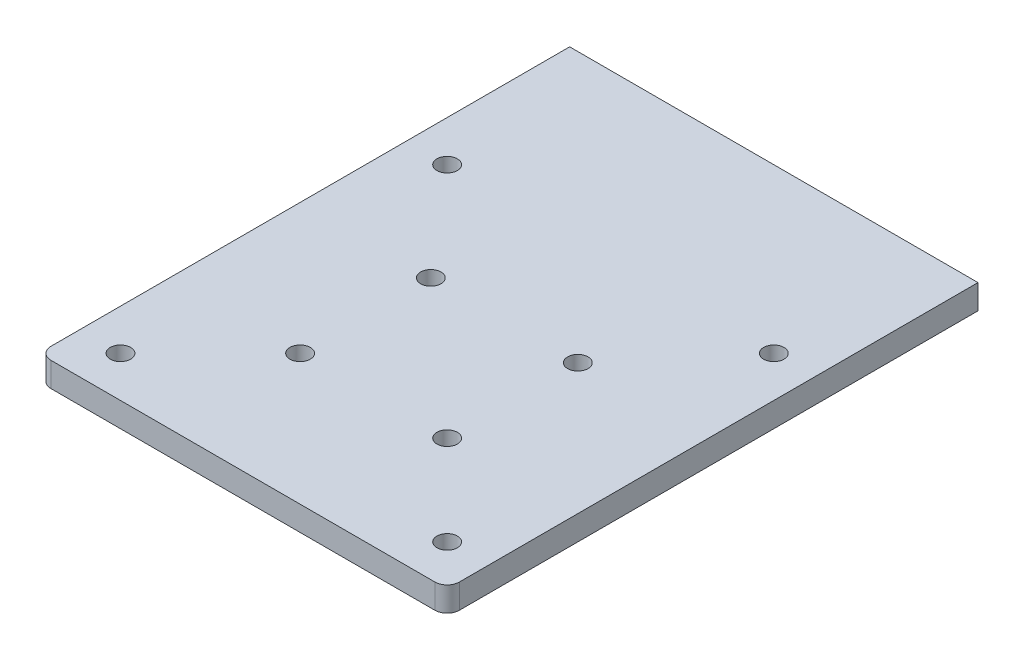
ISO-10303-21;
HEADER;
FILE_DESCRIPTION(('STEP AP214'),'2;1');
FILE_NAME('part.step','',(''),(''),'','','');
FILE_SCHEMA(('AUTOMOTIVE_DESIGN { 1 0 10303 214 1 1 1 1 }'));
ENDSEC;
DATA;
#1=APPLICATION_CONTEXT('core data for automotive mechanical design processes');
#2=APPLICATION_PROTOCOL_DEFINITION('international standard','automotive_design',2000,#1);
#3=PRODUCT_CONTEXT('',#1,'mechanical');
#4=PRODUCT('Part','Part','',(#3));
#5=PRODUCT_RELATED_PRODUCT_CATEGORY('part','',(#4));
#6=PRODUCT_DEFINITION_FORMATION('','',#4);
#7=PRODUCT_DEFINITION_CONTEXT('part definition',#1,'design');
#8=PRODUCT_DEFINITION('design','',#6,#7);
#9=PRODUCT_DEFINITION_SHAPE('','',#8);
#10=(LENGTH_UNIT() NAMED_UNIT(*) SI_UNIT(.MILLI.,.METRE.));
#11=(NAMED_UNIT(*) PLANE_ANGLE_UNIT() SI_UNIT($,.RADIAN.));
#12=(NAMED_UNIT(*) SI_UNIT($,.STERADIAN.) SOLID_ANGLE_UNIT());
#13=UNCERTAINTY_MEASURE_WITH_UNIT(LENGTH_MEASURE(1.E-05),#10,'distance_accuracy_value','');
#14=(GEOMETRIC_REPRESENTATION_CONTEXT(3) GLOBAL_UNCERTAINTY_ASSIGNED_CONTEXT((#13)) GLOBAL_UNIT_ASSIGNED_CONTEXT((#10,
#11,#12)) REPRESENTATION_CONTEXT('',''));
#15=CARTESIAN_POINT('',(0.,0.,0.));
#16=DIRECTION('',(0.,0.,1.));
#17=DIRECTION('',(1.,0.,0.));
#18=AXIS2_PLACEMENT_3D('',#15,#16,#17);
#19=CARTESIAN_POINT('',(0.,6.,0.));
#20=DIRECTION('',(0.,1.,0.));
#21=DIRECTION('',(0.,0.,1.));
#22=AXIS2_PLACEMENT_3D('',#19,#20,#21);
#23=PLANE('',#22);
#24=CARTESIAN_POINT('',(22.,6.,-54.));
#25=DIRECTION('',(0.,1.,0.));
#26=DIRECTION('',(0.,0.,1.));
#27=AXIS2_PLACEMENT_3D('',#24,#25,#26);
#28=CIRCLE('',#27,2.5);
#29=CARTESIAN_POINT('',(22.,6.,-51.5));
#30=VERTEX_POINT('',#29);
#31=EDGE_CURVE('E181',#30,#30,#28,.T.);
#32=ORIENTED_EDGE('',*,*,#31,.F.);
#33=EDGE_LOOP('',(#32));
#34=FACE_BOUND('',#33,.T.);
#35=CARTESIAN_POINT('',(22.,6.,-22.));
#36=DIRECTION('',(0.,1.,0.));
#37=DIRECTION('',(0.,0.,1.));
#38=AXIS2_PLACEMENT_3D('',#35,#36,#37);
#39=CIRCLE('',#38,2.5);
#40=CARTESIAN_POINT('',(22.,6.,-19.5));
#41=VERTEX_POINT('',#40);
#42=EDGE_CURVE('E169',#41,#41,#39,.T.);
#43=ORIENTED_EDGE('',*,*,#42,.F.);
#44=EDGE_LOOP('',(#43));
#45=FACE_BOUND('',#44,.T.);
#46=CARTESIAN_POINT('',(0.,6.,-80.));
#47=DIRECTION('',(0.,1.,0.));
#48=DIRECTION('',(0.,0.,1.));
#49=AXIS2_PLACEMENT_3D('',#46,#47,#48);
#50=CIRCLE('',#49,2.5);
#51=CARTESIAN_POINT('',(0.,6.,-77.5));
#52=VERTEX_POINT('',#51);
#53=EDGE_CURVE('E157',#52,#52,#50,.T.);
#54=ORIENTED_EDGE('',*,*,#53,.F.);
#55=EDGE_LOOP('',(#54));
#56=FACE_BOUND('',#55,.T.);
#57=CARTESIAN_POINT('',(0.,6.,0.));
#58=DIRECTION('',(0.,1.,0.));
#59=DIRECTION('',(0.,0.,1.));
#60=AXIS2_PLACEMENT_3D('',#57,#58,#59);
#61=CIRCLE('',#60,2.5);
#62=CARTESIAN_POINT('',(0.,6.,2.5));
#63=VERTEX_POINT('',#62);
#64=EDGE_CURVE('E116',#63,#63,#61,.T.);
#65=ORIENTED_EDGE('',*,*,#64,.F.);
#66=EDGE_LOOP('',(#65));
#67=FACE_BOUND('',#66,.T.);
#68=DIRECTION('',(0.,0.,1.));
#69=VECTOR('',#68,1.);
#70=CARTESIAN_POINT('',(-10.,6.,-120.));
#71=LINE('',#70,#69);
#72=CARTESIAN_POINT('',(-10.,6.,-120.));
#73=VERTEX_POINT('',#72);
#74=CARTESIAN_POINT('',(-10.,6.,6.99999999999999));
#75=VERTEX_POINT('',#74);
#76=EDGE_CURVE('E121',#73,#75,#71,.T.);
#77=ORIENTED_EDGE('',*,*,#76,.T.);
#78=CARTESIAN_POINT('',(-7.,6.,7.));
#79=DIRECTION('',(0.,1.,0.));
#80=DIRECTION('',(0.,0.,1.));
#81=AXIS2_PLACEMENT_3D('',#78,#79,#80);
#82=CIRCLE('',#81,3.);
#83=CARTESIAN_POINT('',(-7.,6.,10.));
#84=VERTEX_POINT('',#83);
#85=EDGE_CURVE('E42',#75,#84,#82,.T.);
#86=ORIENTED_EDGE('',*,*,#85,.T.);
#87=DIRECTION('',(1.,0.,0.));
#88=VECTOR('',#87,1.);
#89=CARTESIAN_POINT('',(-10.,6.,10.));
#90=LINE('',#89,#88);
#91=CARTESIAN_POINT('',(87.,6.,10.));
#92=VERTEX_POINT('',#91);
#93=EDGE_CURVE('E95',#84,#92,#90,.T.);
#94=ORIENTED_EDGE('',*,*,#93,.T.);
#95=CARTESIAN_POINT('',(87.,6.,6.99999999999999));
#96=DIRECTION('',(0.,1.,0.));
#97=DIRECTION('',(0.,0.,1.));
#98=AXIS2_PLACEMENT_3D('',#95,#96,#97);
#99=CIRCLE('',#98,3.);
#100=CARTESIAN_POINT('',(90.,6.,6.99999999999999));
#101=VERTEX_POINT('',#100);
#102=EDGE_CURVE('E49',#92,#101,#99,.T.);
#103=ORIENTED_EDGE('',*,*,#102,.T.);
#104=DIRECTION('',(0.,0.,-1.));
#105=VECTOR('',#104,1.);
#106=CARTESIAN_POINT('',(90.,6.,-120.));
#107=LINE('',#106,#105);
#108=CARTESIAN_POINT('',(90.,6.,-120.));
#109=VERTEX_POINT('',#108);
#110=EDGE_CURVE('E87',#101,#109,#107,.T.);
#111=ORIENTED_EDGE('',*,*,#110,.T.);
#112=DIRECTION('',(-1.,0.,0.));
#113=VECTOR('',#112,1.);
#114=CARTESIAN_POINT('',(-10.,6.,-120.));
#115=LINE('',#114,#113);
#116=EDGE_CURVE('E91',#109,#73,#115,.T.);
#117=ORIENTED_EDGE('',*,*,#116,.T.);
#118=EDGE_LOOP('',(#77,#86,#94,#103,#111,#117));
#119=FACE_BOUND('',#118,.T.);
#120=CARTESIAN_POINT('',(80.,6.,0.));
#121=DIRECTION('',(0.,1.,0.));
#122=DIRECTION('',(0.,0.,1.));
#123=AXIS2_PLACEMENT_3D('',#120,#121,#122);
#124=CIRCLE('',#123,2.5);
#125=CARTESIAN_POINT('',(80.,6.,2.5));
#126=VERTEX_POINT('',#125);
#127=EDGE_CURVE('E151',#126,#126,#124,.T.);
#128=ORIENTED_EDGE('',*,*,#127,.F.);
#129=EDGE_LOOP('',(#128));
#130=FACE_BOUND('',#129,.T.);
#131=CARTESIAN_POINT('',(80.,6.,-80.));
#132=DIRECTION('',(0.,1.,0.));
#133=DIRECTION('',(0.,0.,1.));
#134=AXIS2_PLACEMENT_3D('',#131,#132,#133);
#135=CIRCLE('',#134,2.5);
#136=CARTESIAN_POINT('',(80.,6.,-77.5));
#137=VERTEX_POINT('',#136);
#138=EDGE_CURVE('E163',#137,#137,#135,.T.);
#139=ORIENTED_EDGE('',*,*,#138,.F.);
#140=EDGE_LOOP('',(#139));
#141=FACE_BOUND('',#140,.T.);
#142=CARTESIAN_POINT('',(58.,6.,-22.));
#143=DIRECTION('',(0.,1.,0.));
#144=DIRECTION('',(0.,0.,1.));
#145=AXIS2_PLACEMENT_3D('',#142,#143,#144);
#146=CIRCLE('',#145,2.5);
#147=CARTESIAN_POINT('',(58.,6.,-19.5));
#148=VERTEX_POINT('',#147);
#149=EDGE_CURVE('E175',#148,#148,#146,.T.);
#150=ORIENTED_EDGE('',*,*,#149,.F.);
#151=EDGE_LOOP('',(#150));
#152=FACE_BOUND('',#151,.T.);
#153=CARTESIAN_POINT('',(58.,6.,-54.));
#154=DIRECTION('',(0.,1.,0.));
#155=DIRECTION('',(0.,0.,1.));
#156=AXIS2_PLACEMENT_3D('',#153,#154,#155);
#157=CIRCLE('',#156,2.50000000000001);
#158=CARTESIAN_POINT('',(58.,6.,-51.5));
#159=VERTEX_POINT('',#158);
#160=EDGE_CURVE('E187',#159,#159,#157,.T.);
#161=ORIENTED_EDGE('',*,*,#160,.F.);
#162=EDGE_LOOP('',(#161));
#163=FACE_BOUND('',#162,.T.);
#164=ADVANCED_FACE('F34',(#34,#45,#56,#67,#119,#130,#141,#152,#163),#23,.T.);
#165=CARTESIAN_POINT('',(0.,0.,0.));
#166=DIRECTION('',(0.,1.,0.));
#167=DIRECTION('',(0.,0.,1.));
#168=AXIS2_PLACEMENT_3D('',#165,#166,#167);
#169=PLANE('',#168);
#170=CARTESIAN_POINT('',(22.,0.,-54.));
#171=DIRECTION('',(0.,1.,0.));
#172=DIRECTION('',(0.,0.,1.));
#173=AXIS2_PLACEMENT_3D('',#170,#171,#172);
#174=CIRCLE('',#173,2.5);
#175=CARTESIAN_POINT('',(22.,0.,-51.5));
#176=VERTEX_POINT('',#175);
#177=EDGE_CURVE('E184',#176,#176,#174,.T.);
#178=ORIENTED_EDGE('',*,*,#177,.T.);
#179=EDGE_LOOP('',(#178));
#180=FACE_BOUND('',#179,.T.);
#181=CARTESIAN_POINT('',(22.,0.,-22.));
#182=DIRECTION('',(0.,1.,0.));
#183=DIRECTION('',(0.,0.,1.));
#184=AXIS2_PLACEMENT_3D('',#181,#182,#183);
#185=CIRCLE('',#184,2.5);
#186=CARTESIAN_POINT('',(22.,0.,-19.5));
#187=VERTEX_POINT('',#186);
#188=EDGE_CURVE('E172',#187,#187,#185,.T.);
#189=ORIENTED_EDGE('',*,*,#188,.T.);
#190=EDGE_LOOP('',(#189));
#191=FACE_BOUND('',#190,.T.);
#192=CARTESIAN_POINT('',(0.,0.,-80.));
#193=DIRECTION('',(0.,1.,0.));
#194=DIRECTION('',(0.,0.,1.));
#195=AXIS2_PLACEMENT_3D('',#192,#193,#194);
#196=CIRCLE('',#195,2.5);
#197=CARTESIAN_POINT('',(0.,0.,-77.5));
#198=VERTEX_POINT('',#197);
#199=EDGE_CURVE('E160',#198,#198,#196,.T.);
#200=ORIENTED_EDGE('',*,*,#199,.T.);
#201=EDGE_LOOP('',(#200));
#202=FACE_BOUND('',#201,.T.);
#203=CARTESIAN_POINT('',(0.,0.,0.));
#204=DIRECTION('',(0.,1.,0.));
#205=DIRECTION('',(0.,0.,1.));
#206=AXIS2_PLACEMENT_3D('',#203,#204,#205);
#207=CIRCLE('',#206,2.5);
#208=CARTESIAN_POINT('',(0.,0.,2.5));
#209=VERTEX_POINT('',#208);
#210=EDGE_CURVE('E148',#209,#209,#207,.T.);
#211=ORIENTED_EDGE('',*,*,#210,.T.);
#212=EDGE_LOOP('',(#211));
#213=FACE_BOUND('',#212,.T.);
#214=DIRECTION('',(1.,0.,0.));
#215=VECTOR('',#214,1.);
#216=CARTESIAN_POINT('',(-10.,0.,10.));
#217=LINE('',#216,#215);
#218=CARTESIAN_POINT('',(-7.,0.,10.));
#219=VERTEX_POINT('',#218);
#220=CARTESIAN_POINT('',(87.,0.,10.));
#221=VERTEX_POINT('',#220);
#222=EDGE_CURVE('E115',#219,#221,#217,.T.);
#223=ORIENTED_EDGE('',*,*,#222,.F.);
#224=CARTESIAN_POINT('',(-7.,0.,7.));
#225=DIRECTION('',(0.,1.,0.));
#226=DIRECTION('',(0.,0.,1.));
#227=AXIS2_PLACEMENT_3D('',#224,#225,#226);
#228=CIRCLE('',#227,3.);
#229=CARTESIAN_POINT('',(-10.,0.,6.99999999999999));
#230=VERTEX_POINT('',#229);
#231=EDGE_CURVE('E129',#219,#230,#228,.F.);
#232=ORIENTED_EDGE('',*,*,#231,.T.);
#233=DIRECTION('',(0.,0.,1.));
#234=VECTOR('',#233,1.);
#235=CARTESIAN_POINT('',(-10.,0.,-120.));
#236=LINE('',#235,#234);
#237=CARTESIAN_POINT('',(-10.,0.,-120.));
#238=VERTEX_POINT('',#237);
#239=EDGE_CURVE('E113',#238,#230,#236,.T.);
#240=ORIENTED_EDGE('',*,*,#239,.F.);
#241=DIRECTION('',(-1.,0.,0.));
#242=VECTOR('',#241,1.);
#243=CARTESIAN_POINT('',(-10.,0.,-120.));
#244=LINE('',#243,#242);
#245=CARTESIAN_POINT('',(90.,0.,-120.));
#246=VERTEX_POINT('',#245);
#247=EDGE_CURVE('E120',#246,#238,#244,.T.);
#248=ORIENTED_EDGE('',*,*,#247,.F.);
#249=DIRECTION('',(0.,0.,-1.));
#250=VECTOR('',#249,1.);
#251=CARTESIAN_POINT('',(90.,0.,-120.));
#252=LINE('',#251,#250);
#253=CARTESIAN_POINT('',(90.,0.,6.99999999999999));
#254=VERTEX_POINT('',#253);
#255=EDGE_CURVE('E101',#254,#246,#252,.T.);
#256=ORIENTED_EDGE('',*,*,#255,.F.);
#257=CARTESIAN_POINT('',(87.,0.,6.99999999999999));
#258=DIRECTION('',(0.,1.,0.));
#259=DIRECTION('',(0.,0.,1.));
#260=AXIS2_PLACEMENT_3D('',#257,#258,#259);
#261=CIRCLE('',#260,3.);
#262=EDGE_CURVE('E127',#254,#221,#261,.F.);
#263=ORIENTED_EDGE('',*,*,#262,.T.);
#264=EDGE_LOOP('',(#223,#232,#240,#248,#256,#263));
#265=FACE_BOUND('',#264,.T.);
#266=CARTESIAN_POINT('',(80.,0.,0.));
#267=DIRECTION('',(0.,1.,0.));
#268=DIRECTION('',(0.,0.,1.));
#269=AXIS2_PLACEMENT_3D('',#266,#267,#268);
#270=CIRCLE('',#269,2.5);
#271=CARTESIAN_POINT('',(80.,0.,2.5));
#272=VERTEX_POINT('',#271);
#273=EDGE_CURVE('E154',#272,#272,#270,.T.);
#274=ORIENTED_EDGE('',*,*,#273,.T.);
#275=EDGE_LOOP('',(#274));
#276=FACE_BOUND('',#275,.T.);
#277=CARTESIAN_POINT('',(80.,0.,-80.));
#278=DIRECTION('',(0.,1.,0.));
#279=DIRECTION('',(0.,0.,1.));
#280=AXIS2_PLACEMENT_3D('',#277,#278,#279);
#281=CIRCLE('',#280,2.5);
#282=CARTESIAN_POINT('',(80.,0.,-77.5));
#283=VERTEX_POINT('',#282);
#284=EDGE_CURVE('E166',#283,#283,#281,.T.);
#285=ORIENTED_EDGE('',*,*,#284,.T.);
#286=EDGE_LOOP('',(#285));
#287=FACE_BOUND('',#286,.T.);
#288=CARTESIAN_POINT('',(58.,0.,-22.));
#289=DIRECTION('',(0.,1.,0.));
#290=DIRECTION('',(0.,0.,1.));
#291=AXIS2_PLACEMENT_3D('',#288,#289,#290);
#292=CIRCLE('',#291,2.5);
#293=CARTESIAN_POINT('',(58.,0.,-19.5));
#294=VERTEX_POINT('',#293);
#295=EDGE_CURVE('E178',#294,#294,#292,.T.);
#296=ORIENTED_EDGE('',*,*,#295,.T.);
#297=EDGE_LOOP('',(#296));
#298=FACE_BOUND('',#297,.T.);
#299=CARTESIAN_POINT('',(58.,0.,-54.));
#300=DIRECTION('',(0.,1.,0.));
#301=DIRECTION('',(0.,0.,1.));
#302=AXIS2_PLACEMENT_3D('',#299,#300,#301);
#303=CIRCLE('',#302,2.50000000000001);
#304=CARTESIAN_POINT('',(58.,0.,-51.5));
#305=VERTEX_POINT('',#304);
#306=EDGE_CURVE('E190',#305,#305,#303,.T.);
#307=ORIENTED_EDGE('',*,*,#306,.T.);
#308=EDGE_LOOP('',(#307));
#309=FACE_BOUND('',#308,.T.);
#310=ADVANCED_FACE('F143',(#180,#191,#202,#213,#265,#276,#287,#298,#309),#169,.F.);
#311=CARTESIAN_POINT('',(-10.,6.,-120.));
#312=DIRECTION('',(1.,0.,0.));
#313=DIRECTION('',(0.,0.,-1.));
#314=AXIS2_PLACEMENT_3D('',#311,#312,#313);
#315=PLANE('',#314);
#316=ORIENTED_EDGE('',*,*,#239,.T.);
#317=DIRECTION('',(0.,-1.,0.));
#318=VECTOR('',#317,1.);
#319=CARTESIAN_POINT('',(-10.,6.,6.99999999999999));
#320=LINE('',#319,#318);
#321=EDGE_CURVE('E57',#230,#75,#320,.F.);
#322=ORIENTED_EDGE('',*,*,#321,.T.);
#323=ORIENTED_EDGE('',*,*,#76,.F.);
#324=DIRECTION('',(0.,-1.,0.));
#325=VECTOR('',#324,1.);
#326=CARTESIAN_POINT('',(-10.,6.,-120.));
#327=LINE('',#326,#325);
#328=EDGE_CURVE('E105',#73,#238,#327,.T.);
#329=ORIENTED_EDGE('',*,*,#328,.T.);
#330=EDGE_LOOP('',(#316,#322,#323,#329));
#331=FACE_BOUND('',#330,.T.);
#332=ADVANCED_FACE('F145',(#331),#315,.F.);
#333=CARTESIAN_POINT('',(-10.,6.,10.));
#334=DIRECTION('',(0.,0.,-1.));
#335=DIRECTION('',(-1.,0.,0.));
#336=AXIS2_PLACEMENT_3D('',#333,#334,#335);
#337=PLANE('',#336);
#338=ORIENTED_EDGE('',*,*,#93,.F.);
#339=DIRECTION('',(0.,-1.,0.));
#340=VECTOR('',#339,1.);
#341=CARTESIAN_POINT('',(-7.,6.,10.));
#342=LINE('',#341,#340);
#343=EDGE_CURVE('E124',#84,#219,#342,.T.);
#344=ORIENTED_EDGE('',*,*,#343,.T.);
#345=ORIENTED_EDGE('',*,*,#222,.T.);
#346=DIRECTION('',(0.,-1.,0.));
#347=VECTOR('',#346,1.);
#348=CARTESIAN_POINT('',(87.,6.,10.));
#349=LINE('',#348,#347);
#350=EDGE_CURVE('E104',#221,#92,#349,.F.);
#351=ORIENTED_EDGE('',*,*,#350,.T.);
#352=EDGE_LOOP('',(#338,#344,#345,#351));
#353=FACE_BOUND('',#352,.T.);
#354=ADVANCED_FACE('F137',(#353),#337,.F.);
#355=CARTESIAN_POINT('',(90.,6.,-120.));
#356=DIRECTION('',(-1.,0.,0.));
#357=DIRECTION('',(0.,0.,1.));
#358=AXIS2_PLACEMENT_3D('',#355,#356,#357);
#359=PLANE('',#358);
#360=ORIENTED_EDGE('',*,*,#110,.F.);
#361=DIRECTION('',(0.,-1.,0.));
#362=VECTOR('',#361,1.);
#363=CARTESIAN_POINT('',(90.,6.,6.99999999999999));
#364=LINE('',#363,#362);
#365=EDGE_CURVE('E11',#101,#254,#364,.T.);
#366=ORIENTED_EDGE('',*,*,#365,.T.);
#367=ORIENTED_EDGE('',*,*,#255,.T.);
#368=DIRECTION('',(0.,-1.,0.));
#369=VECTOR('',#368,1.);
#370=CARTESIAN_POINT('',(90.,6.,-120.));
#371=LINE('',#370,#369);
#372=EDGE_CURVE('E98',#109,#246,#371,.T.);
#373=ORIENTED_EDGE('',*,*,#372,.F.);
#374=EDGE_LOOP('',(#360,#366,#367,#373));
#375=FACE_BOUND('',#374,.T.);
#376=ADVANCED_FACE('F99',(#375),#359,.F.);
#377=CARTESIAN_POINT('',(-10.,6.,-120.));
#378=DIRECTION('',(0.,0.,1.));
#379=DIRECTION('',(1.,0.,0.));
#380=AXIS2_PLACEMENT_3D('',#377,#378,#379);
#381=PLANE('',#380);
#382=ORIENTED_EDGE('',*,*,#247,.T.);
#383=ORIENTED_EDGE('',*,*,#328,.F.);
#384=ORIENTED_EDGE('',*,*,#116,.F.);
#385=ORIENTED_EDGE('',*,*,#372,.T.);
#386=EDGE_LOOP('',(#382,#383,#384,#385));
#387=FACE_BOUND('',#386,.T.);
#388=ADVANCED_FACE('F107',(#387),#381,.F.);
#389=CARTESIAN_POINT('',(0.,6.,0.));
#390=DIRECTION('',(0.,-1.,0.));
#391=DIRECTION('',(0.,0.,-1.));
#392=AXIS2_PLACEMENT_3D('',#389,#390,#391);
#393=CYLINDRICAL_SURFACE('',#392,2.5);
#394=ORIENTED_EDGE('',*,*,#64,.T.);
#395=EDGE_LOOP('',(#394));
#396=FACE_BOUND('',#395,.T.);
#397=ORIENTED_EDGE('',*,*,#210,.F.);
#398=EDGE_LOOP('',(#397));
#399=FACE_BOUND('',#398,.T.);
#400=ADVANCED_FACE('F210',(#396,#399),#393,.F.);
#401=CARTESIAN_POINT('',(80.,6.,0.));
#402=DIRECTION('',(0.,-1.,0.));
#403=DIRECTION('',(0.,0.,-1.));
#404=AXIS2_PLACEMENT_3D('',#401,#402,#403);
#405=CYLINDRICAL_SURFACE('',#404,2.5);
#406=ORIENTED_EDGE('',*,*,#127,.T.);
#407=EDGE_LOOP('',(#406));
#408=FACE_BOUND('',#407,.T.);
#409=ORIENTED_EDGE('',*,*,#273,.F.);
#410=EDGE_LOOP('',(#409));
#411=FACE_BOUND('',#410,.T.);
#412=ADVANCED_FACE('F248',(#408,#411),#405,.F.);
#413=CARTESIAN_POINT('',(0.,6.,-80.));
#414=DIRECTION('',(0.,-1.,0.));
#415=DIRECTION('',(0.,0.,-1.));
#416=AXIS2_PLACEMENT_3D('',#413,#414,#415);
#417=CYLINDRICAL_SURFACE('',#416,2.5);
#418=ORIENTED_EDGE('',*,*,#53,.T.);
#419=EDGE_LOOP('',(#418));
#420=FACE_BOUND('',#419,.T.);
#421=ORIENTED_EDGE('',*,*,#199,.F.);
#422=EDGE_LOOP('',(#421));
#423=FACE_BOUND('',#422,.T.);
#424=ADVANCED_FACE('F245',(#420,#423),#417,.F.);
#425=CARTESIAN_POINT('',(80.,6.,-80.));
#426=DIRECTION('',(0.,-1.,0.));
#427=DIRECTION('',(0.,0.,-1.));
#428=AXIS2_PLACEMENT_3D('',#425,#426,#427);
#429=CYLINDRICAL_SURFACE('',#428,2.5);
#430=ORIENTED_EDGE('',*,*,#138,.T.);
#431=EDGE_LOOP('',(#430));
#432=FACE_BOUND('',#431,.T.);
#433=ORIENTED_EDGE('',*,*,#284,.F.);
#434=EDGE_LOOP('',(#433));
#435=FACE_BOUND('',#434,.T.);
#436=ADVANCED_FACE('F241',(#432,#435),#429,.F.);
#437=CARTESIAN_POINT('',(22.,6.,-22.));
#438=DIRECTION('',(0.,-1.,0.));
#439=DIRECTION('',(0.,0.,-1.));
#440=AXIS2_PLACEMENT_3D('',#437,#438,#439);
#441=CYLINDRICAL_SURFACE('',#440,2.5);
#442=ORIENTED_EDGE('',*,*,#42,.T.);
#443=EDGE_LOOP('',(#442));
#444=FACE_BOUND('',#443,.T.);
#445=ORIENTED_EDGE('',*,*,#188,.F.);
#446=EDGE_LOOP('',(#445));
#447=FACE_BOUND('',#446,.T.);
#448=ADVANCED_FACE('F237',(#444,#447),#441,.F.);
#449=CARTESIAN_POINT('',(58.,6.,-22.));
#450=DIRECTION('',(0.,-1.,0.));
#451=DIRECTION('',(0.,0.,-1.));
#452=AXIS2_PLACEMENT_3D('',#449,#450,#451);
#453=CYLINDRICAL_SURFACE('',#452,2.5);
#454=ORIENTED_EDGE('',*,*,#149,.T.);
#455=EDGE_LOOP('',(#454));
#456=FACE_BOUND('',#455,.T.);
#457=ORIENTED_EDGE('',*,*,#295,.F.);
#458=EDGE_LOOP('',(#457));
#459=FACE_BOUND('',#458,.T.);
#460=ADVANCED_FACE('F231',(#456,#459),#453,.F.);
#461=CARTESIAN_POINT('',(22.,6.,-54.));
#462=DIRECTION('',(0.,-1.,0.));
#463=DIRECTION('',(0.,0.,-1.));
#464=AXIS2_PLACEMENT_3D('',#461,#462,#463);
#465=CYLINDRICAL_SURFACE('',#464,2.5);
#466=ORIENTED_EDGE('',*,*,#31,.T.);
#467=EDGE_LOOP('',(#466));
#468=FACE_BOUND('',#467,.T.);
#469=ORIENTED_EDGE('',*,*,#177,.F.);
#470=EDGE_LOOP('',(#469));
#471=FACE_BOUND('',#470,.T.);
#472=ADVANCED_FACE('F226',(#468,#471),#465,.F.);
#473=CARTESIAN_POINT('',(58.,6.,-54.));
#474=DIRECTION('',(0.,-1.,0.));
#475=DIRECTION('',(0.,0.,-1.));
#476=AXIS2_PLACEMENT_3D('',#473,#474,#475);
#477=CYLINDRICAL_SURFACE('',#476,2.50000000000001);
#478=ORIENTED_EDGE('',*,*,#160,.T.);
#479=EDGE_LOOP('',(#478));
#480=FACE_BOUND('',#479,.T.);
#481=ORIENTED_EDGE('',*,*,#306,.F.);
#482=EDGE_LOOP('',(#481));
#483=FACE_BOUND('',#482,.T.);
#484=ADVANCED_FACE('F196',(#480,#483),#477,.F.);
#485=CARTESIAN_POINT('',(-7.,6.,7.));
#486=DIRECTION('',(0.,-1.,0.));
#487=DIRECTION('',(0.,0.,-1.));
#488=AXIS2_PLACEMENT_3D('',#485,#486,#487);
#489=CYLINDRICAL_SURFACE('',#488,3.);
#490=ORIENTED_EDGE('',*,*,#85,.F.);
#491=ORIENTED_EDGE('',*,*,#321,.F.);
#492=ORIENTED_EDGE('',*,*,#231,.F.);
#493=ORIENTED_EDGE('',*,*,#343,.F.);
#494=EDGE_LOOP('',(#490,#491,#492,#493));
#495=FACE_BOUND('',#494,.T.);
#496=ADVANCED_FACE('F140',(#495),#489,.T.);
#497=CARTESIAN_POINT('',(87.,6.,6.99999999999999));
#498=DIRECTION('',(0.,-1.,0.));
#499=DIRECTION('',(0.,0.,-1.));
#500=AXIS2_PLACEMENT_3D('',#497,#498,#499);
#501=CYLINDRICAL_SURFACE('',#500,3.);
#502=ORIENTED_EDGE('',*,*,#102,.F.);
#503=ORIENTED_EDGE('',*,*,#350,.F.);
#504=ORIENTED_EDGE('',*,*,#262,.F.);
#505=ORIENTED_EDGE('',*,*,#365,.F.);
#506=EDGE_LOOP('',(#502,#503,#504,#505));
#507=FACE_BOUND('',#506,.T.);
#508=ADVANCED_FACE('F36',(#507),#501,.T.);
#509=CLOSED_SHELL('',(#164,#310,#332,#354,#376,#388,#400,#412,#424,#436,#448,#460,#472,#484,
#496,#508));
#510=MANIFOLD_SOLID_BREP('B2',#509);
#511=ADVANCED_BREP_SHAPE_REPRESENTATION('',(#18,#510),#14);
#512=SHAPE_DEFINITION_REPRESENTATION(#9,#511);
ENDSEC;
END-ISO-10303-21;
